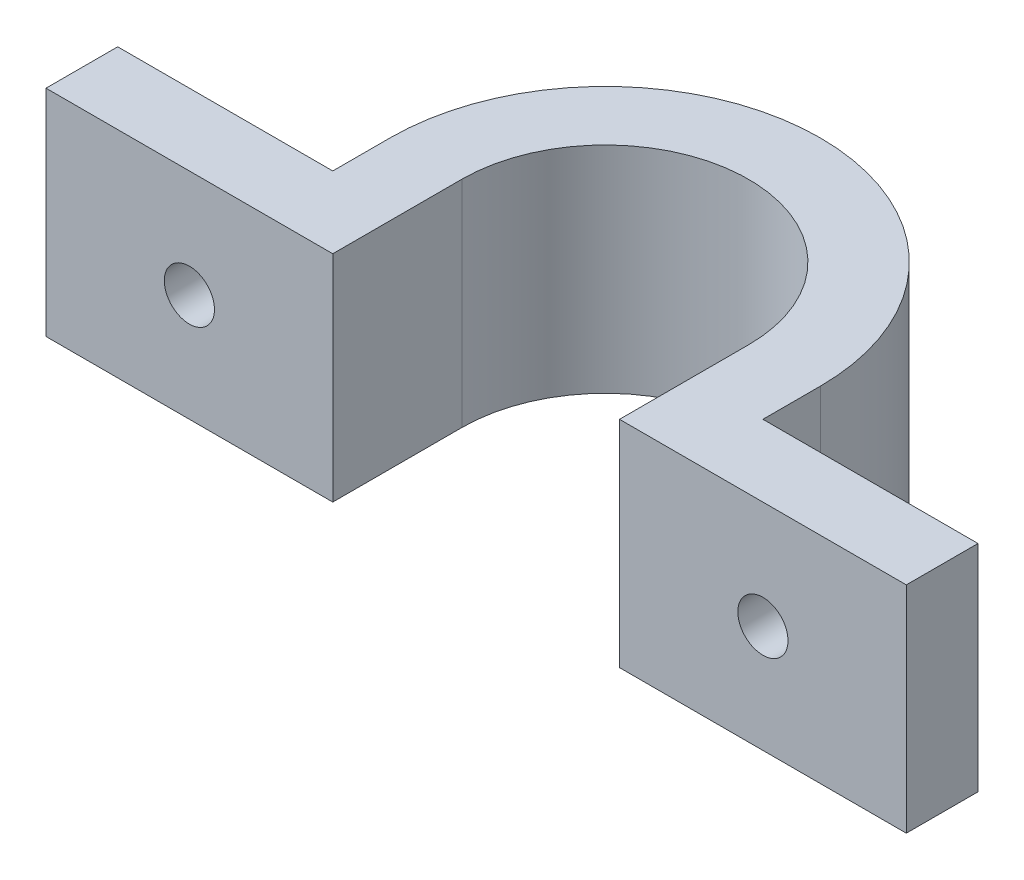
ISO-10303-21;
HEADER;
FILE_DESCRIPTION(('STEP AP214'),'2;1');
FILE_NAME('part.step','',(''),(''),'','','');
FILE_SCHEMA(('AUTOMOTIVE_DESIGN { 1 0 10303 214 1 1 1 1 }'));
ENDSEC;
DATA;
#1=APPLICATION_CONTEXT('core data for automotive mechanical design processes');
#2=APPLICATION_PROTOCOL_DEFINITION('international standard','automotive_design',2000,#1);
#3=PRODUCT_CONTEXT('',#1,'mechanical');
#4=PRODUCT('Part','Part','',(#3));
#5=PRODUCT_RELATED_PRODUCT_CATEGORY('part','',(#4));
#6=PRODUCT_DEFINITION_FORMATION('','',#4);
#7=PRODUCT_DEFINITION_CONTEXT('part definition',#1,'design');
#8=PRODUCT_DEFINITION('design','',#6,#7);
#9=PRODUCT_DEFINITION_SHAPE('','',#8);
#10=(LENGTH_UNIT() NAMED_UNIT(*) SI_UNIT(.MILLI.,.METRE.));
#11=(NAMED_UNIT(*) PLANE_ANGLE_UNIT() SI_UNIT($,.RADIAN.));
#12=(NAMED_UNIT(*) SI_UNIT($,.STERADIAN.) SOLID_ANGLE_UNIT());
#13=UNCERTAINTY_MEASURE_WITH_UNIT(LENGTH_MEASURE(1.E-05),#10,'distance_accuracy_value','');
#14=(GEOMETRIC_REPRESENTATION_CONTEXT(3) GLOBAL_UNCERTAINTY_ASSIGNED_CONTEXT((#13)) GLOBAL_UNIT_ASSIGNED_CONTEXT((#10,
#11,#12)) REPRESENTATION_CONTEXT('',''));
#15=CARTESIAN_POINT('',(0.,0.,0.));
#16=DIRECTION('',(0.,0.,1.));
#17=DIRECTION('',(1.,0.,0.));
#18=AXIS2_PLACEMENT_3D('',#15,#16,#17);
#19=CARTESIAN_POINT('',(15.,15.,4.));
#20=DIRECTION('',(0.,0.,1.));
#21=DIRECTION('',(1.,0.,0.));
#22=AXIS2_PLACEMENT_3D('',#19,#20,#21);
#23=PLANE('',#22);
#24=CARTESIAN_POINT('',(20.,7.5,4.));
#25=DIRECTION('',(0.,0.,-1.));
#26=DIRECTION('',(-1.,0.,0.));
#27=AXIS2_PLACEMENT_3D('',#24,#25,#26);
#28=CIRCLE('',#27,1.75);
#29=CARTESIAN_POINT('',(18.25,7.5,4.));
#30=VERTEX_POINT('',#29);
#31=EDGE_CURVE('E271',#30,#30,#28,.T.);
#32=ORIENTED_EDGE('',*,*,#31,.F.);
#33=EDGE_LOOP('',(#32));
#34=FACE_BOUND('',#33,.T.);
#35=DIRECTION('',(-1.,0.,0.));
#36=VECTOR('',#35,1.);
#37=CARTESIAN_POINT('',(15.,0.,4.));
#38=LINE('',#37,#36);
#39=CARTESIAN_POINT('',(30.,0.,4.));
#40=VERTEX_POINT('',#39);
#41=CARTESIAN_POINT('',(15.,0.,4.));
#42=VERTEX_POINT('',#41);
#43=EDGE_CURVE('E159',#40,#42,#38,.T.);
#44=ORIENTED_EDGE('',*,*,#43,.T.);
#45=DIRECTION('',(0.,-1.,0.));
#46=VECTOR('',#45,1.);
#47=CARTESIAN_POINT('',(15.,15.,4.));
#48=LINE('',#47,#46);
#49=CARTESIAN_POINT('',(15.,15.,4.));
#50=VERTEX_POINT('',#49);
#51=EDGE_CURVE('E11',#50,#42,#48,.T.);
#52=ORIENTED_EDGE('',*,*,#51,.F.);
#53=DIRECTION('',(-1.,0.,0.));
#54=VECTOR('',#53,1.);
#55=CARTESIAN_POINT('',(15.,15.,4.));
#56=LINE('',#55,#54);
#57=CARTESIAN_POINT('',(30.,15.,4.));
#58=VERTEX_POINT('',#57);
#59=EDGE_CURVE('E182',#58,#50,#56,.T.);
#60=ORIENTED_EDGE('',*,*,#59,.F.);
#61=DIRECTION('',(0.,-1.,0.));
#62=VECTOR('',#61,1.);
#63=CARTESIAN_POINT('',(30.,15.,4.));
#64=LINE('',#63,#62);
#65=EDGE_CURVE('E155',#58,#40,#64,.T.);
#66=ORIENTED_EDGE('',*,*,#65,.T.);
#67=EDGE_LOOP('',(#44,#52,#60,#66));
#68=FACE_BOUND('',#67,.T.);
#69=ADVANCED_FACE('F39',(#34,#68),#23,.F.);
#70=CARTESIAN_POINT('',(15.,15.,0.));
#71=DIRECTION('',(-1.,0.,0.));
#72=DIRECTION('',(0.,0.,1.));
#73=AXIS2_PLACEMENT_3D('',#70,#71,#72);
#74=PLANE('',#73);
#75=DIRECTION('',(0.,0.,-1.));
#76=VECTOR('',#75,1.);
#77=CARTESIAN_POINT('',(15.,0.,0.));
#78=LINE('',#77,#76);
#79=CARTESIAN_POINT('',(15.,0.,0.));
#80=VERTEX_POINT('',#79);
#81=EDGE_CURVE('E162',#42,#80,#78,.T.);
#82=ORIENTED_EDGE('',*,*,#81,.T.);
#83=DIRECTION('',(0.,-1.,0.));
#84=VECTOR('',#83,1.);
#85=CARTESIAN_POINT('',(15.,15.,0.));
#86=LINE('',#85,#84);
#87=CARTESIAN_POINT('',(15.,15.,0.));
#88=VERTEX_POINT('',#87);
#89=EDGE_CURVE('E47',#88,#80,#86,.T.);
#90=ORIENTED_EDGE('',*,*,#89,.F.);
#91=DIRECTION('',(0.,0.,-1.));
#92=VECTOR('',#91,1.);
#93=CARTESIAN_POINT('',(15.,15.,0.));
#94=LINE('',#93,#92);
#95=EDGE_CURVE('E110',#50,#88,#94,.T.);
#96=ORIENTED_EDGE('',*,*,#95,.F.);
#97=ORIENTED_EDGE('',*,*,#51,.T.);
#98=EDGE_LOOP('',(#82,#90,#96,#97));
#99=FACE_BOUND('',#98,.T.);
#100=ADVANCED_FACE('F262',(#99),#74,.F.);
#101=CARTESIAN_POINT('',(0.,15.,0.));
#102=DIRECTION('',(0.,-1.,0.));
#103=DIRECTION('',(0.,0.,-1.));
#104=AXIS2_PLACEMENT_3D('',#101,#102,#103);
#105=CYLINDRICAL_SURFACE('',#104,15.);
#106=CARTESIAN_POINT('',(0.,0.,0.));
#107=DIRECTION('',(0.,1.,0.));
#108=DIRECTION('',(0.,0.,1.));
#109=AXIS2_PLACEMENT_3D('',#106,#107,#108);
#110=CIRCLE('',#109,15.);
#111=CARTESIAN_POINT('',(-15.,0.,0.));
#112=VERTEX_POINT('',#111);
#113=EDGE_CURVE('E165',#80,#112,#110,.T.);
#114=ORIENTED_EDGE('',*,*,#113,.T.);
#115=DIRECTION('',(0.,-1.,0.));
#116=VECTOR('',#115,1.);
#117=CARTESIAN_POINT('',(-15.,15.,0.));
#118=LINE('',#117,#116);
#119=CARTESIAN_POINT('',(-15.,15.,0.));
#120=VERTEX_POINT('',#119);
#121=EDGE_CURVE('E201',#120,#112,#118,.T.);
#122=ORIENTED_EDGE('',*,*,#121,.F.);
#123=CARTESIAN_POINT('',(0.,15.,0.));
#124=DIRECTION('',(0.,1.,0.));
#125=DIRECTION('',(0.,0.,1.));
#126=AXIS2_PLACEMENT_3D('',#123,#124,#125);
#127=CIRCLE('',#126,15.);
#128=EDGE_CURVE('E209',#88,#120,#127,.T.);
#129=ORIENTED_EDGE('',*,*,#128,.F.);
#130=ORIENTED_EDGE('',*,*,#89,.T.);
#131=EDGE_LOOP('',(#114,#122,#129,#130));
#132=FACE_BOUND('',#131,.T.);
#133=ADVANCED_FACE('F207',(#132),#105,.T.);
#134=CARTESIAN_POINT('',(-15.,15.,0.));
#135=DIRECTION('',(1.,0.,0.));
#136=DIRECTION('',(0.,0.,-1.));
#137=AXIS2_PLACEMENT_3D('',#134,#135,#136);
#138=PLANE('',#137);
#139=DIRECTION('',(0.,0.,1.));
#140=VECTOR('',#139,1.);
#141=CARTESIAN_POINT('',(-15.,0.,0.));
#142=LINE('',#141,#140);
#143=CARTESIAN_POINT('',(-15.,0.,4.));
#144=VERTEX_POINT('',#143);
#145=EDGE_CURVE('E167',#112,#144,#142,.T.);
#146=ORIENTED_EDGE('',*,*,#145,.T.);
#147=DIRECTION('',(0.,-1.,0.));
#148=VECTOR('',#147,1.);
#149=CARTESIAN_POINT('',(-15.,15.,4.));
#150=LINE('',#149,#148);
#151=CARTESIAN_POINT('',(-15.,15.,4.));
#152=VERTEX_POINT('',#151);
#153=EDGE_CURVE('E198',#152,#144,#150,.T.);
#154=ORIENTED_EDGE('',*,*,#153,.F.);
#155=DIRECTION('',(0.,0.,1.));
#156=VECTOR('',#155,1.);
#157=CARTESIAN_POINT('',(-15.,15.,0.));
#158=LINE('',#157,#156);
#159=EDGE_CURVE('E227',#120,#152,#158,.T.);
#160=ORIENTED_EDGE('',*,*,#159,.F.);
#161=ORIENTED_EDGE('',*,*,#121,.T.);
#162=EDGE_LOOP('',(#146,#154,#160,#161));
#163=FACE_BOUND('',#162,.T.);
#164=ADVANCED_FACE('F218',(#163),#138,.F.);
#165=CARTESIAN_POINT('',(-15.,15.,4.));
#166=DIRECTION('',(0.,0.,1.));
#167=DIRECTION('',(1.,0.,0.));
#168=AXIS2_PLACEMENT_3D('',#165,#166,#167);
#169=PLANE('',#168);
#170=CARTESIAN_POINT('',(-20.,7.5,4.));
#171=DIRECTION('',(0.,0.,-1.));
#172=DIRECTION('',(-1.,0.,0.));
#173=AXIS2_PLACEMENT_3D('',#170,#171,#172);
#174=CIRCLE('',#173,1.75);
#175=CARTESIAN_POINT('',(-21.75,7.5,4.));
#176=VERTEX_POINT('',#175);
#177=EDGE_CURVE('E273',#176,#176,#174,.T.);
#178=ORIENTED_EDGE('',*,*,#177,.F.);
#179=EDGE_LOOP('',(#178));
#180=FACE_BOUND('',#179,.T.);
#181=DIRECTION('',(-1.,0.,0.));
#182=VECTOR('',#181,1.);
#183=CARTESIAN_POINT('',(-15.,0.,4.));
#184=LINE('',#183,#182);
#185=CARTESIAN_POINT('',(-30.,0.,4.));
#186=VERTEX_POINT('',#185);
#187=EDGE_CURVE('E169',#144,#186,#184,.T.);
#188=ORIENTED_EDGE('',*,*,#187,.T.);
#189=DIRECTION('',(0.,-1.,0.));
#190=VECTOR('',#189,1.);
#191=CARTESIAN_POINT('',(-30.,15.,4.));
#192=LINE('',#191,#190);
#193=CARTESIAN_POINT('',(-30.,15.,4.));
#194=VERTEX_POINT('',#193);
#195=EDGE_CURVE('E195',#194,#186,#192,.T.);
#196=ORIENTED_EDGE('',*,*,#195,.F.);
#197=DIRECTION('',(-1.,0.,0.));
#198=VECTOR('',#197,1.);
#199=CARTESIAN_POINT('',(-15.,15.,4.));
#200=LINE('',#199,#198);
#201=EDGE_CURVE('E224',#152,#194,#200,.T.);
#202=ORIENTED_EDGE('',*,*,#201,.F.);
#203=ORIENTED_EDGE('',*,*,#153,.T.);
#204=EDGE_LOOP('',(#188,#196,#202,#203));
#205=FACE_BOUND('',#204,.T.);
#206=ADVANCED_FACE('F222',(#180,#205),#169,.F.);
#207=CARTESIAN_POINT('',(-30.,15.,4.));
#208=DIRECTION('',(1.,0.,0.));
#209=DIRECTION('',(0.,0.,-1.));
#210=AXIS2_PLACEMENT_3D('',#207,#208,#209);
#211=PLANE('',#210);
#212=DIRECTION('',(0.,0.,1.));
#213=VECTOR('',#212,1.);
#214=CARTESIAN_POINT('',(-30.,0.,4.));
#215=LINE('',#214,#213);
#216=CARTESIAN_POINT('',(-30.,0.,9.));
#217=VERTEX_POINT('',#216);
#218=EDGE_CURVE('E171',#186,#217,#215,.T.);
#219=ORIENTED_EDGE('',*,*,#218,.T.);
#220=DIRECTION('',(0.,-1.,0.));
#221=VECTOR('',#220,1.);
#222=CARTESIAN_POINT('',(-30.,15.,9.));
#223=LINE('',#222,#221);
#224=CARTESIAN_POINT('',(-30.,15.,9.));
#225=VERTEX_POINT('',#224);
#226=EDGE_CURVE('E192',#225,#217,#223,.T.);
#227=ORIENTED_EDGE('',*,*,#226,.F.);
#228=DIRECTION('',(0.,0.,1.));
#229=VECTOR('',#228,1.);
#230=CARTESIAN_POINT('',(-30.,15.,4.));
#231=LINE('',#230,#229);
#232=EDGE_CURVE('E226',#194,#225,#231,.T.);
#233=ORIENTED_EDGE('',*,*,#232,.F.);
#234=ORIENTED_EDGE('',*,*,#195,.T.);
#235=EDGE_LOOP('',(#219,#227,#233,#234));
#236=FACE_BOUND('',#235,.T.);
#237=ADVANCED_FACE('F296',(#236),#211,.F.);
#238=CARTESIAN_POINT('',(-30.,15.,9.));
#239=DIRECTION('',(0.,0.,-1.));
#240=DIRECTION('',(-1.,0.,0.));
#241=AXIS2_PLACEMENT_3D('',#238,#239,#240);
#242=PLANE('',#241);
#243=CARTESIAN_POINT('',(-20.,7.5,9.));
#244=DIRECTION('',(0.,0.,-1.));
#245=DIRECTION('',(-1.,0.,0.));
#246=AXIS2_PLACEMENT_3D('',#243,#244,#245);
#247=CIRCLE('',#246,1.75);
#248=CARTESIAN_POINT('',(-21.75,7.5,9.));
#249=VERTEX_POINT('',#248);
#250=EDGE_CURVE('E278',#249,#249,#247,.T.);
#251=ORIENTED_EDGE('',*,*,#250,.T.);
#252=EDGE_LOOP('',(#251));
#253=FACE_BOUND('',#252,.T.);
#254=DIRECTION('',(1.,0.,0.));
#255=VECTOR('',#254,1.);
#256=CARTESIAN_POINT('',(-30.,0.,9.));
#257=LINE('',#256,#255);
#258=CARTESIAN_POINT('',(-10.,0.,9.));
#259=VERTEX_POINT('',#258);
#260=EDGE_CURVE('E173',#217,#259,#257,.T.);
#261=ORIENTED_EDGE('',*,*,#260,.T.);
#262=DIRECTION('',(0.,-1.,0.));
#263=VECTOR('',#262,1.);
#264=CARTESIAN_POINT('',(-10.,15.,9.));
#265=LINE('',#264,#263);
#266=CARTESIAN_POINT('',(-10.,15.,9.));
#267=VERTEX_POINT('',#266);
#268=EDGE_CURVE('E189',#267,#259,#265,.T.);
#269=ORIENTED_EDGE('',*,*,#268,.F.);
#270=DIRECTION('',(1.,0.,0.));
#271=VECTOR('',#270,1.);
#272=CARTESIAN_POINT('',(-30.,15.,9.));
#273=LINE('',#272,#271);
#274=EDGE_CURVE('E229',#225,#267,#273,.T.);
#275=ORIENTED_EDGE('',*,*,#274,.F.);
#276=ORIENTED_EDGE('',*,*,#226,.T.);
#277=EDGE_LOOP('',(#261,#269,#275,#276));
#278=FACE_BOUND('',#277,.T.);
#279=ADVANCED_FACE('F286',(#253,#278),#242,.F.);
#280=CARTESIAN_POINT('',(-10.,15.,9.));
#281=DIRECTION('',(-1.,0.,0.));
#282=DIRECTION('',(0.,0.,1.));
#283=AXIS2_PLACEMENT_3D('',#280,#281,#282);
#284=PLANE('',#283);
#285=DIRECTION('',(0.,0.,-1.));
#286=VECTOR('',#285,1.);
#287=CARTESIAN_POINT('',(-10.,0.,9.));
#288=LINE('',#287,#286);
#289=CARTESIAN_POINT('',(-10.,0.,0.));
#290=VERTEX_POINT('',#289);
#291=EDGE_CURVE('E175',#259,#290,#288,.T.);
#292=ORIENTED_EDGE('',*,*,#291,.T.);
#293=DIRECTION('',(0.,-1.,0.));
#294=VECTOR('',#293,1.);
#295=CARTESIAN_POINT('',(-10.,15.,0.));
#296=LINE('',#295,#294);
#297=CARTESIAN_POINT('',(-10.,15.,0.));
#298=VERTEX_POINT('',#297);
#299=EDGE_CURVE('E186',#298,#290,#296,.T.);
#300=ORIENTED_EDGE('',*,*,#299,.F.);
#301=DIRECTION('',(0.,0.,-1.));
#302=VECTOR('',#301,1.);
#303=CARTESIAN_POINT('',(-10.,15.,9.));
#304=LINE('',#303,#302);
#305=EDGE_CURVE('E235',#267,#298,#304,.T.);
#306=ORIENTED_EDGE('',*,*,#305,.F.);
#307=ORIENTED_EDGE('',*,*,#268,.T.);
#308=EDGE_LOOP('',(#292,#300,#306,#307));
#309=FACE_BOUND('',#308,.T.);
#310=ADVANCED_FACE('F241',(#309),#284,.F.);
#311=CARTESIAN_POINT('',(0.,15.,0.));
#312=DIRECTION('',(0.,-1.,0.));
#313=DIRECTION('',(0.,0.,-1.));
#314=AXIS2_PLACEMENT_3D('',#311,#312,#313);
#315=CYLINDRICAL_SURFACE('',#314,10.);
#316=CARTESIAN_POINT('',(0.,0.,0.));
#317=DIRECTION('',(0.,-1.,0.));
#318=DIRECTION('',(0.,0.,-1.));
#319=AXIS2_PLACEMENT_3D('',#316,#317,#318);
#320=CIRCLE('',#319,10.);
#321=CARTESIAN_POINT('',(10.,0.,0.));
#322=VERTEX_POINT('',#321);
#323=EDGE_CURVE('E177',#290,#322,#320,.T.);
#324=ORIENTED_EDGE('',*,*,#323,.T.);
#325=DIRECTION('',(0.,-1.,0.));
#326=VECTOR('',#325,1.);
#327=CARTESIAN_POINT('',(10.,15.,0.));
#328=LINE('',#327,#326);
#329=CARTESIAN_POINT('',(10.,15.,0.));
#330=VERTEX_POINT('',#329);
#331=EDGE_CURVE('E150',#330,#322,#328,.T.);
#332=ORIENTED_EDGE('',*,*,#331,.F.);
#333=CARTESIAN_POINT('',(0.,15.,0.));
#334=DIRECTION('',(0.,-1.,0.));
#335=DIRECTION('',(0.,0.,-1.));
#336=AXIS2_PLACEMENT_3D('',#333,#334,#335);
#337=CIRCLE('',#336,10.);
#338=EDGE_CURVE('E141',#298,#330,#337,.T.);
#339=ORIENTED_EDGE('',*,*,#338,.F.);
#340=ORIENTED_EDGE('',*,*,#299,.T.);
#341=EDGE_LOOP('',(#324,#332,#339,#340));
#342=FACE_BOUND('',#341,.T.);
#343=ADVANCED_FACE('F245',(#342),#315,.F.);
#344=CARTESIAN_POINT('',(10.,15.,9.));
#345=DIRECTION('',(1.,0.,0.));
#346=DIRECTION('',(0.,0.,-1.));
#347=AXIS2_PLACEMENT_3D('',#344,#345,#346);
#348=PLANE('',#347);
#349=DIRECTION('',(0.,0.,1.));
#350=VECTOR('',#349,1.);
#351=CARTESIAN_POINT('',(10.,0.,9.));
#352=LINE('',#351,#350);
#353=CARTESIAN_POINT('',(10.,0.,9.));
#354=VERTEX_POINT('',#353);
#355=EDGE_CURVE('E149',#322,#354,#352,.T.);
#356=ORIENTED_EDGE('',*,*,#355,.T.);
#357=DIRECTION('',(0.,-1.,0.));
#358=VECTOR('',#357,1.);
#359=CARTESIAN_POINT('',(10.,15.,9.));
#360=LINE('',#359,#358);
#361=CARTESIAN_POINT('',(10.,15.,9.));
#362=VERTEX_POINT('',#361);
#363=EDGE_CURVE('E146',#362,#354,#360,.T.);
#364=ORIENTED_EDGE('',*,*,#363,.F.);
#365=DIRECTION('',(0.,0.,1.));
#366=VECTOR('',#365,1.);
#367=CARTESIAN_POINT('',(10.,15.,9.));
#368=LINE('',#367,#366);
#369=EDGE_CURVE('E135',#330,#362,#368,.T.);
#370=ORIENTED_EDGE('',*,*,#369,.F.);
#371=ORIENTED_EDGE('',*,*,#331,.T.);
#372=EDGE_LOOP('',(#356,#364,#370,#371));
#373=FACE_BOUND('',#372,.T.);
#374=ADVANCED_FACE('F147',(#373),#348,.F.);
#375=CARTESIAN_POINT('',(30.,15.,9.));
#376=DIRECTION('',(0.,0.,-1.));
#377=DIRECTION('',(-1.,0.,0.));
#378=AXIS2_PLACEMENT_3D('',#375,#376,#377);
#379=PLANE('',#378);
#380=CARTESIAN_POINT('',(20.,7.5,9.));
#381=DIRECTION('',(0.,0.,-1.));
#382=DIRECTION('',(-1.,0.,0.));
#383=AXIS2_PLACEMENT_3D('',#380,#381,#382);
#384=CIRCLE('',#383,1.75);
#385=CARTESIAN_POINT('',(18.25,7.5,9.));
#386=VERTEX_POINT('',#385);
#387=EDGE_CURVE('E163',#386,#386,#384,.T.);
#388=ORIENTED_EDGE('',*,*,#387,.T.);
#389=EDGE_LOOP('',(#388));
#390=FACE_BOUND('',#389,.T.);
#391=DIRECTION('',(1.,0.,0.));
#392=VECTOR('',#391,1.);
#393=CARTESIAN_POINT('',(30.,0.,9.));
#394=LINE('',#393,#392);
#395=CARTESIAN_POINT('',(30.,0.,9.));
#396=VERTEX_POINT('',#395);
#397=EDGE_CURVE('E96',#354,#396,#394,.T.);
#398=ORIENTED_EDGE('',*,*,#397,.T.);
#399=DIRECTION('',(0.,-1.,0.));
#400=VECTOR('',#399,1.);
#401=CARTESIAN_POINT('',(30.,15.,9.));
#402=LINE('',#401,#400);
#403=CARTESIAN_POINT('',(30.,15.,9.));
#404=VERTEX_POINT('',#403);
#405=EDGE_CURVE('E151',#404,#396,#402,.T.);
#406=ORIENTED_EDGE('',*,*,#405,.F.);
#407=DIRECTION('',(1.,0.,0.));
#408=VECTOR('',#407,1.);
#409=CARTESIAN_POINT('',(30.,15.,9.));
#410=LINE('',#409,#408);
#411=EDGE_CURVE('E139',#362,#404,#410,.T.);
#412=ORIENTED_EDGE('',*,*,#411,.F.);
#413=ORIENTED_EDGE('',*,*,#363,.T.);
#414=EDGE_LOOP('',(#398,#406,#412,#413));
#415=FACE_BOUND('',#414,.T.);
#416=ADVANCED_FACE('F153',(#390,#415),#379,.F.);
#417=CARTESIAN_POINT('',(30.,15.,4.));
#418=DIRECTION('',(-1.,0.,0.));
#419=DIRECTION('',(0.,0.,1.));
#420=AXIS2_PLACEMENT_3D('',#417,#418,#419);
#421=PLANE('',#420);
#422=DIRECTION('',(0.,0.,-1.));
#423=VECTOR('',#422,1.);
#424=CARTESIAN_POINT('',(30.,0.,4.));
#425=LINE('',#424,#423);
#426=EDGE_CURVE('E102',#396,#40,#425,.T.);
#427=ORIENTED_EDGE('',*,*,#426,.T.);
#428=ORIENTED_EDGE('',*,*,#65,.F.);
#429=DIRECTION('',(0.,0.,-1.));
#430=VECTOR('',#429,1.);
#431=CARTESIAN_POINT('',(30.,15.,4.));
#432=LINE('',#431,#430);
#433=EDGE_CURVE('E55',#404,#58,#432,.T.);
#434=ORIENTED_EDGE('',*,*,#433,.F.);
#435=ORIENTED_EDGE('',*,*,#405,.T.);
#436=EDGE_LOOP('',(#427,#428,#434,#435));
#437=FACE_BOUND('',#436,.T.);
#438=ADVANCED_FACE('F249',(#437),#421,.F.);
#439=CARTESIAN_POINT('',(0.,15.,0.));
#440=DIRECTION('',(0.,-1.,0.));
#441=DIRECTION('',(0.,0.,-1.));
#442=AXIS2_PLACEMENT_3D('',#439,#440,#441);
#443=PLANE('',#442);
#444=ORIENTED_EDGE('',*,*,#59,.T.);
#445=ORIENTED_EDGE('',*,*,#95,.T.);
#446=ORIENTED_EDGE('',*,*,#128,.T.);
#447=ORIENTED_EDGE('',*,*,#159,.T.);
#448=ORIENTED_EDGE('',*,*,#201,.T.);
#449=ORIENTED_EDGE('',*,*,#232,.T.);
#450=ORIENTED_EDGE('',*,*,#274,.T.);
#451=ORIENTED_EDGE('',*,*,#305,.T.);
#452=ORIENTED_EDGE('',*,*,#338,.T.);
#453=ORIENTED_EDGE('',*,*,#369,.T.);
#454=ORIENTED_EDGE('',*,*,#411,.T.);
#455=ORIENTED_EDGE('',*,*,#433,.T.);
#456=EDGE_LOOP('',(#444,#445,#446,#447,#448,#449,#450,#451,#452,#453,#454,#455));
#457=FACE_BOUND('',#456,.T.);
#458=ADVANCED_FACE('F137',(#457),#443,.F.);
#459=CARTESIAN_POINT('',(0.,0.,0.));
#460=DIRECTION('',(0.,-1.,0.));
#461=DIRECTION('',(0.,0.,-1.));
#462=AXIS2_PLACEMENT_3D('',#459,#460,#461);
#463=PLANE('',#462);
#464=ORIENTED_EDGE('',*,*,#43,.F.);
#465=ORIENTED_EDGE('',*,*,#426,.F.);
#466=ORIENTED_EDGE('',*,*,#397,.F.);
#467=ORIENTED_EDGE('',*,*,#355,.F.);
#468=ORIENTED_EDGE('',*,*,#323,.F.);
#469=ORIENTED_EDGE('',*,*,#291,.F.);
#470=ORIENTED_EDGE('',*,*,#260,.F.);
#471=ORIENTED_EDGE('',*,*,#218,.F.);
#472=ORIENTED_EDGE('',*,*,#187,.F.);
#473=ORIENTED_EDGE('',*,*,#145,.F.);
#474=ORIENTED_EDGE('',*,*,#113,.F.);
#475=ORIENTED_EDGE('',*,*,#81,.F.);
#476=EDGE_LOOP('',(#464,#465,#466,#467,#468,#469,#470,#471,#472,#473,#474,#475));
#477=FACE_BOUND('',#476,.T.);
#478=ADVANCED_FACE('F213',(#477),#463,.T.);
#479=CARTESIAN_POINT('',(20.,7.5,9.));
#480=DIRECTION('',(0.,0.,-1.));
#481=DIRECTION('',(-1.,0.,0.));
#482=AXIS2_PLACEMENT_3D('',#479,#480,#481);
#483=CYLINDRICAL_SURFACE('',#482,1.75);
#484=ORIENTED_EDGE('',*,*,#387,.F.);
#485=EDGE_LOOP('',(#484));
#486=FACE_BOUND('',#485,.T.);
#487=ORIENTED_EDGE('',*,*,#31,.T.);
#488=EDGE_LOOP('',(#487));
#489=FACE_BOUND('',#488,.T.);
#490=ADVANCED_FACE('F292',(#486,#489),#483,.F.);
#491=CARTESIAN_POINT('',(-20.,7.5,9.));
#492=DIRECTION('',(0.,0.,-1.));
#493=DIRECTION('',(-1.,0.,0.));
#494=AXIS2_PLACEMENT_3D('',#491,#492,#493);
#495=CYLINDRICAL_SURFACE('',#494,1.75);
#496=ORIENTED_EDGE('',*,*,#250,.F.);
#497=EDGE_LOOP('',(#496));
#498=FACE_BOUND('',#497,.T.);
#499=ORIENTED_EDGE('',*,*,#177,.T.);
#500=EDGE_LOOP('',(#499));
#501=FACE_BOUND('',#500,.T.);
#502=ADVANCED_FACE('F289',(#498,#501),#495,.F.);
#503=CLOSED_SHELL('',(#69,#100,#133,#164,#206,#237,#279,#310,#343,#374,#416,#438,#458,#478,#490,#502));
#504=MANIFOLD_SOLID_BREP('B2',#503);
#505=ADVANCED_BREP_SHAPE_REPRESENTATION('',(#18,#504),#14);
#506=SHAPE_DEFINITION_REPRESENTATION(#9,#505);
ENDSEC;
END-ISO-10303-21;
